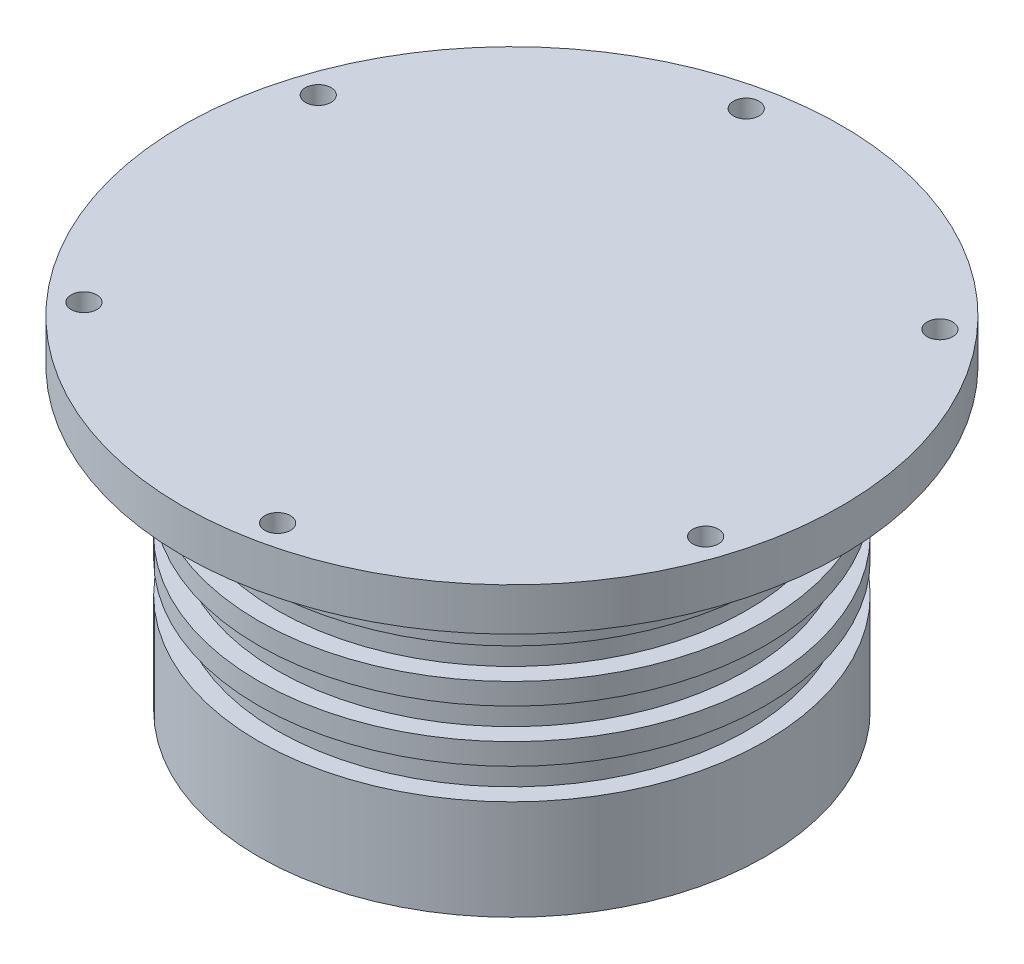
ISO-10303-21;
HEADER;
FILE_DESCRIPTION(('STEP AP214'),'2;1');
FILE_NAME('part.step','',(''),(''),'','','');
FILE_SCHEMA(('AUTOMOTIVE_DESIGN { 1 0 10303 214 1 1 1 1 }'));
ENDSEC;
DATA;
#1=APPLICATION_CONTEXT('core data for automotive mechanical design processes');
#2=APPLICATION_PROTOCOL_DEFINITION('international standard','automotive_design',2000,#1);
#3=PRODUCT_CONTEXT('',#1,'mechanical');
#4=PRODUCT('Part','Part','',(#3));
#5=PRODUCT_RELATED_PRODUCT_CATEGORY('part','',(#4));
#6=PRODUCT_DEFINITION_FORMATION('','',#4);
#7=PRODUCT_DEFINITION_CONTEXT('part definition',#1,'design');
#8=PRODUCT_DEFINITION('design','',#6,#7);
#9=PRODUCT_DEFINITION_SHAPE('','',#8);
#10=(LENGTH_UNIT() NAMED_UNIT(*) SI_UNIT(.MILLI.,.METRE.));
#11=(NAMED_UNIT(*) PLANE_ANGLE_UNIT() SI_UNIT($,.RADIAN.));
#12=(NAMED_UNIT(*) SI_UNIT($,.STERADIAN.) SOLID_ANGLE_UNIT());
#13=UNCERTAINTY_MEASURE_WITH_UNIT(LENGTH_MEASURE(1.E-05),#10,'distance_accuracy_value','');
#14=(GEOMETRIC_REPRESENTATION_CONTEXT(3) GLOBAL_UNCERTAINTY_ASSIGNED_CONTEXT((#13)) GLOBAL_UNIT_ASSIGNED_CONTEXT((#10,
#11,#12)) REPRESENTATION_CONTEXT('',''));
#15=CARTESIAN_POINT('',(0.,0.,0.));
#16=DIRECTION('',(0.,0.,1.));
#17=DIRECTION('',(1.,0.,0.));
#18=AXIS2_PLACEMENT_3D('',#15,#16,#17);
#19=CARTESIAN_POINT('',(0.,93.9493256003392,0.));
#20=DIRECTION('',(0.,-1.,0.));
#21=DIRECTION('',(0.,0.,-1.));
#22=AXIS2_PLACEMENT_3D('',#19,#20,#21);
#23=PLANE('',#22);
#24=CARTESIAN_POINT('',(-67.4160325954417,93.9493256003392,-22.0808095207213));
#25=DIRECTION('',(0.,-1.,0.));
#26=DIRECTION('',(0.,0.,-1.));
#27=AXIS2_PLACEMENT_3D('',#24,#25,#26);
#28=CIRCLE('',#27,3.00000000000001);
#29=CARTESIAN_POINT('',(-67.4160325954417,93.9493256003392,-25.0808095207213));
#30=VERTEX_POINT('',#29);
#31=EDGE_CURVE('E78',#30,#30,#28,.F.);
#32=ORIENTED_EDGE('',*,*,#31,.F.);
#33=EDGE_LOOP('',(#32));
#34=FACE_BOUND('',#33,.T.);
#35=CARTESIAN_POINT('',(-14.5854743166509,93.9493256003392,-69.4244016103729));
#36=DIRECTION('',(0.,-1.,0.));
#37=DIRECTION('',(0.,0.,-1.));
#38=AXIS2_PLACEMENT_3D('',#35,#36,#37);
#39=CIRCLE('',#38,3.);
#40=CARTESIAN_POINT('',(-14.5854743166509,93.9493256003392,-72.4244016103729));
#41=VERTEX_POINT('',#40);
#42=EDGE_CURVE('E66',#41,#41,#39,.F.);
#43=ORIENTED_EDGE('',*,*,#42,.F.);
#44=EDGE_LOOP('',(#43));
#45=FACE_BOUND('',#44,.T.);
#46=CARTESIAN_POINT('',(52.8305582787908,93.9493256003392,-47.3435920896516));
#47=DIRECTION('',(0.,-1.,0.));
#48=DIRECTION('',(0.,0.,-1.));
#49=AXIS2_PLACEMENT_3D('',#46,#47,#48);
#50=CIRCLE('',#49,3.);
#51=CARTESIAN_POINT('',(52.8305582787908,93.9493256003392,-50.3435920896516));
#52=VERTEX_POINT('',#51);
#53=EDGE_CURVE('E63',#52,#52,#50,.F.);
#54=ORIENTED_EDGE('',*,*,#53,.F.);
#55=EDGE_LOOP('',(#54));
#56=FACE_BOUND('',#55,.T.);
#57=CARTESIAN_POINT('',(67.4160325954416,93.9493256003392,22.0808095207213));
#58=DIRECTION('',(0.,-1.,0.));
#59=DIRECTION('',(0.,0.,-1.));
#60=AXIS2_PLACEMENT_3D('',#57,#58,#59);
#61=CIRCLE('',#60,3.00000000000001);
#62=CARTESIAN_POINT('',(67.4160325954416,93.9493256003392,19.0808095207213));
#63=VERTEX_POINT('',#62);
#64=EDGE_CURVE('E60',#63,#63,#61,.F.);
#65=ORIENTED_EDGE('',*,*,#64,.F.);
#66=EDGE_LOOP('',(#65));
#67=FACE_BOUND('',#66,.T.);
#68=CARTESIAN_POINT('',(14.5854743166508,93.9493256003392,69.4244016103729));
#69=DIRECTION('',(0.,-1.,0.));
#70=DIRECTION('',(0.,0.,-1.));
#71=AXIS2_PLACEMENT_3D('',#68,#69,#70);
#72=CIRCLE('',#71,3.);
#73=CARTESIAN_POINT('',(14.5854743166508,93.9493256003392,66.4244016103729));
#74=VERTEX_POINT('',#73);
#75=EDGE_CURVE('E56',#74,#74,#72,.F.);
#76=ORIENTED_EDGE('',*,*,#75,.F.);
#77=EDGE_LOOP('',(#76));
#78=FACE_BOUND('',#77,.T.);
#79=CARTESIAN_POINT('',(-52.8305582787908,93.9493256003392,47.3435920896516));
#80=DIRECTION('',(0.,-1.,0.));
#81=DIRECTION('',(0.,0.,-1.));
#82=AXIS2_PLACEMENT_3D('',#79,#80,#81);
#83=CIRCLE('',#82,3.);
#84=CARTESIAN_POINT('',(-52.8305582787908,93.9493256003392,44.3435920896516));
#85=VERTEX_POINT('',#84);
#86=EDGE_CURVE('E52',#85,#85,#83,.F.);
#87=ORIENTED_EDGE('',*,*,#86,.F.);
#88=EDGE_LOOP('',(#87));
#89=FACE_BOUND('',#88,.T.);
#90=CARTESIAN_POINT('',(0.,93.9493256003392,0.));
#91=DIRECTION('',(0.,1.,0.));
#92=DIRECTION('',(0.,0.,1.));
#93=AXIS2_PLACEMENT_3D('',#90,#91,#92);
#94=CIRCLE('',#93,77.14);
#95=CARTESIAN_POINT('',(0.,93.9493256003392,77.14));
#96=VERTEX_POINT('',#95);
#97=EDGE_CURVE('E10',#96,#96,#94,.T.);
#98=ORIENTED_EDGE('',*,*,#97,.T.);
#99=EDGE_LOOP('',(#98));
#100=FACE_BOUND('',#99,.T.);
#101=ADVANCED_FACE('F33',(#34,#45,#56,#67,#78,#89,#100),#23,.F.);
#102=CARTESIAN_POINT('',(0.,93.9493256003392,0.));
#103=DIRECTION('',(0.,1.,0.));
#104=DIRECTION('',(0.,0.,1.));
#105=AXIS2_PLACEMENT_3D('',#102,#103,#104);
#106=CYLINDRICAL_SURFACE('',#105,77.14);
#107=ORIENTED_EDGE('',*,*,#97,.F.);
#108=EDGE_LOOP('',(#107));
#109=FACE_BOUND('',#108,.T.);
#110=CARTESIAN_POINT('',(0.,83.9493256003392,0.));
#111=DIRECTION('',(0.,1.,0.));
#112=DIRECTION('',(0.,0.,1.));
#113=AXIS2_PLACEMENT_3D('',#110,#111,#112);
#114=CIRCLE('',#113,77.14);
#115=CARTESIAN_POINT('',(0.,83.9493256003392,77.14));
#116=VERTEX_POINT('',#115);
#117=EDGE_CURVE('E40',#116,#116,#114,.T.);
#118=ORIENTED_EDGE('',*,*,#117,.T.);
#119=EDGE_LOOP('',(#118));
#120=FACE_BOUND('',#119,.T.);
#121=ADVANCED_FACE('F213',(#109,#120),#106,.T.);
#122=CARTESIAN_POINT('',(77.14,83.9493256003392,0.));
#123=DIRECTION('',(0.,1.,0.));
#124=DIRECTION('',(0.,0.,1.));
#125=AXIS2_PLACEMENT_3D('',#122,#123,#124);
#126=PLANE('',#125);
#127=CARTESIAN_POINT('',(-67.4160325954417,83.9493256003392,-22.0808095207213));
#128=DIRECTION('',(0.,1.,0.));
#129=DIRECTION('',(0.,0.,1.));
#130=AXIS2_PLACEMENT_3D('',#127,#128,#129);
#131=CIRCLE('',#130,3.00000000000001);
#132=CARTESIAN_POINT('',(-67.4160325954417,83.9493256003392,-19.0808095207213));
#133=VERTEX_POINT('',#132);
#134=EDGE_CURVE('E36',#133,#133,#131,.F.);
#135=ORIENTED_EDGE('',*,*,#134,.F.);
#136=EDGE_LOOP('',(#135));
#137=FACE_BOUND('',#136,.T.);
#138=CARTESIAN_POINT('',(-14.5854743166509,83.9493256003392,-69.4244016103729));
#139=DIRECTION('',(0.,1.,0.));
#140=DIRECTION('',(0.,0.,1.));
#141=AXIS2_PLACEMENT_3D('',#138,#139,#140);
#142=CIRCLE('',#141,3.);
#143=CARTESIAN_POINT('',(-14.5854743166509,83.9493256003392,-66.4244016103729));
#144=VERTEX_POINT('',#143);
#145=EDGE_CURVE('E64',#144,#144,#142,.F.);
#146=ORIENTED_EDGE('',*,*,#145,.F.);
#147=EDGE_LOOP('',(#146));
#148=FACE_BOUND('',#147,.T.);
#149=CARTESIAN_POINT('',(52.8305582787908,83.9493256003392,-47.3435920896516));
#150=DIRECTION('',(0.,1.,0.));
#151=DIRECTION('',(0.,0.,1.));
#152=AXIS2_PLACEMENT_3D('',#149,#150,#151);
#153=CIRCLE('',#152,3.);
#154=CARTESIAN_POINT('',(52.8305582787908,83.9493256003392,-44.3435920896516));
#155=VERTEX_POINT('',#154);
#156=EDGE_CURVE('E61',#155,#155,#153,.F.);
#157=ORIENTED_EDGE('',*,*,#156,.F.);
#158=EDGE_LOOP('',(#157));
#159=FACE_BOUND('',#158,.T.);
#160=CARTESIAN_POINT('',(67.4160325954416,83.9493256003392,22.0808095207213));
#161=DIRECTION('',(0.,1.,0.));
#162=DIRECTION('',(0.,0.,1.));
#163=AXIS2_PLACEMENT_3D('',#160,#161,#162);
#164=CIRCLE('',#163,3.00000000000001);
#165=CARTESIAN_POINT('',(67.4160325954416,83.9493256003392,25.0808095207213));
#166=VERTEX_POINT('',#165);
#167=EDGE_CURVE('E57',#166,#166,#164,.F.);
#168=ORIENTED_EDGE('',*,*,#167,.F.);
#169=EDGE_LOOP('',(#168));
#170=FACE_BOUND('',#169,.T.);
#171=CARTESIAN_POINT('',(14.5854743166508,83.9493256003392,69.4244016103729));
#172=DIRECTION('',(0.,1.,0.));
#173=DIRECTION('',(0.,0.,1.));
#174=AXIS2_PLACEMENT_3D('',#171,#172,#173);
#175=CIRCLE('',#174,3.);
#176=CARTESIAN_POINT('',(14.5854743166508,83.9493256003392,72.4244016103729));
#177=VERTEX_POINT('',#176);
#178=EDGE_CURVE('E53',#177,#177,#175,.F.);
#179=ORIENTED_EDGE('',*,*,#178,.F.);
#180=EDGE_LOOP('',(#179));
#181=FACE_BOUND('',#180,.T.);
#182=CARTESIAN_POINT('',(-52.8305582787908,83.9493256003392,47.3435920896516));
#183=DIRECTION('',(0.,1.,0.));
#184=DIRECTION('',(0.,0.,1.));
#185=AXIS2_PLACEMENT_3D('',#182,#183,#184);
#186=CIRCLE('',#185,3.);
#187=CARTESIAN_POINT('',(-52.8305582787908,83.9493256003392,50.3435920896516));
#188=VERTEX_POINT('',#187);
#189=EDGE_CURVE('E49',#188,#188,#186,.F.);
#190=ORIENTED_EDGE('',*,*,#189,.F.);
#191=EDGE_LOOP('',(#190));
#192=FACE_BOUND('',#191,.T.);
#193=ORIENTED_EDGE('',*,*,#117,.F.);
#194=EDGE_LOOP('',(#193));
#195=FACE_BOUND('',#194,.T.);
#196=CARTESIAN_POINT('',(0.,83.9493256003392,0.));
#197=DIRECTION('',(0.,1.,0.));
#198=DIRECTION('',(0.,0.,1.));
#199=AXIS2_PLACEMENT_3D('',#196,#197,#198);
#200=CIRCLE('',#199,59.3);
#201=CARTESIAN_POINT('',(0.,83.9493256003392,59.3));
#202=VERTEX_POINT('',#201);
#203=EDGE_CURVE('E45',#202,#202,#200,.T.);
#204=ORIENTED_EDGE('',*,*,#203,.T.);
#205=EDGE_LOOP('',(#204));
#206=FACE_BOUND('',#205,.T.);
#207=ADVANCED_FACE('F122',(#137,#148,#159,#170,#181,#192,#195,#206),#126,.F.);
#208=CARTESIAN_POINT('',(0.,93.9493256003392,0.));
#209=DIRECTION('',(0.,1.,0.));
#210=DIRECTION('',(0.,0.,1.));
#211=AXIS2_PLACEMENT_3D('',#208,#209,#210);
#212=CYLINDRICAL_SURFACE('',#211,59.3);
#213=ORIENTED_EDGE('',*,*,#203,.F.);
#214=EDGE_LOOP('',(#213));
#215=FACE_BOUND('',#214,.T.);
#216=CARTESIAN_POINT('',(0.,68.9493256003392,0.));
#217=DIRECTION('',(0.,1.,0.));
#218=DIRECTION('',(0.,0.,1.));
#219=AXIS2_PLACEMENT_3D('',#216,#217,#218);
#220=CIRCLE('',#219,59.3);
#221=CARTESIAN_POINT('',(0.,68.9493256003392,59.3));
#222=VERTEX_POINT('',#221);
#223=EDGE_CURVE('E117',#222,#222,#220,.T.);
#224=ORIENTED_EDGE('',*,*,#223,.T.);
#225=EDGE_LOOP('',(#224));
#226=FACE_BOUND('',#225,.T.);
#227=ADVANCED_FACE('F124',(#215,#226),#212,.T.);
#228=CARTESIAN_POINT('',(59.3,68.9493256003392,0.));
#229=DIRECTION('',(0.,1.,0.));
#230=DIRECTION('',(0.,0.,1.));
#231=AXIS2_PLACEMENT_3D('',#228,#229,#230);
#232=PLANE('',#231);
#233=ORIENTED_EDGE('',*,*,#223,.F.);
#234=EDGE_LOOP('',(#233));
#235=FACE_BOUND('',#234,.T.);
#236=CARTESIAN_POINT('',(0.,68.9493256003392,0.));
#237=DIRECTION('',(0.,1.,0.));
#238=DIRECTION('',(0.,0.,1.));
#239=AXIS2_PLACEMENT_3D('',#236,#237,#238);
#240=CIRCLE('',#239,55.);
#241=CARTESIAN_POINT('',(0.,68.9493256003392,55.));
#242=VERTEX_POINT('',#241);
#243=EDGE_CURVE('E114',#242,#242,#240,.T.);
#244=ORIENTED_EDGE('',*,*,#243,.T.);
#245=EDGE_LOOP('',(#244));
#246=FACE_BOUND('',#245,.T.);
#247=ADVANCED_FACE('F127',(#235,#246),#232,.F.);
#248=CARTESIAN_POINT('',(0.,93.9493256003392,0.));
#249=DIRECTION('',(0.,1.,0.));
#250=DIRECTION('',(0.,0.,1.));
#251=AXIS2_PLACEMENT_3D('',#248,#249,#250);
#252=CYLINDRICAL_SURFACE('',#251,55.);
#253=ORIENTED_EDGE('',*,*,#243,.F.);
#254=EDGE_LOOP('',(#253));
#255=FACE_BOUND('',#254,.T.);
#256=CARTESIAN_POINT('',(0.,61.7493256003392,0.));
#257=DIRECTION('',(0.,1.,0.));
#258=DIRECTION('',(0.,0.,1.));
#259=AXIS2_PLACEMENT_3D('',#256,#257,#258);
#260=CIRCLE('',#259,55.);
#261=CARTESIAN_POINT('',(0.,61.7493256003392,55.));
#262=VERTEX_POINT('',#261);
#263=EDGE_CURVE('E111',#262,#262,#260,.T.);
#264=ORIENTED_EDGE('',*,*,#263,.T.);
#265=EDGE_LOOP('',(#264));
#266=FACE_BOUND('',#265,.T.);
#267=ADVANCED_FACE('F133',(#255,#266),#252,.T.);
#268=CARTESIAN_POINT('',(55.,61.7493256003392,0.));
#269=DIRECTION('',(0.,-1.,0.));
#270=DIRECTION('',(0.,0.,-1.));
#271=AXIS2_PLACEMENT_3D('',#268,#269,#270);
#272=PLANE('',#271);
#273=ORIENTED_EDGE('',*,*,#263,.F.);
#274=EDGE_LOOP('',(#273));
#275=FACE_BOUND('',#274,.T.);
#276=CARTESIAN_POINT('',(0.,61.7493256003392,0.));
#277=DIRECTION('',(0.,1.,0.));
#278=DIRECTION('',(0.,0.,1.));
#279=AXIS2_PLACEMENT_3D('',#276,#277,#278);
#280=CIRCLE('',#279,59.3);
#281=CARTESIAN_POINT('',(0.,61.7493256003392,59.3));
#282=VERTEX_POINT('',#281);
#283=EDGE_CURVE('E108',#282,#282,#280,.T.);
#284=ORIENTED_EDGE('',*,*,#283,.T.);
#285=EDGE_LOOP('',(#284));
#286=FACE_BOUND('',#285,.T.);
#287=ADVANCED_FACE('F139',(#275,#286),#272,.F.);
#288=CARTESIAN_POINT('',(0.,93.9493256003392,0.));
#289=DIRECTION('',(0.,1.,0.));
#290=DIRECTION('',(0.,0.,1.));
#291=AXIS2_PLACEMENT_3D('',#288,#289,#290);
#292=CYLINDRICAL_SURFACE('',#291,59.3);
#293=ORIENTED_EDGE('',*,*,#283,.F.);
#294=EDGE_LOOP('',(#293));
#295=FACE_BOUND('',#294,.T.);
#296=CARTESIAN_POINT('',(0.,56.7493256003392,0.));
#297=DIRECTION('',(0.,1.,0.));
#298=DIRECTION('',(0.,0.,1.));
#299=AXIS2_PLACEMENT_3D('',#296,#297,#298);
#300=CIRCLE('',#299,59.2999999999999);
#301=CARTESIAN_POINT('',(0.,56.7493256003392,59.2999999999999));
#302=VERTEX_POINT('',#301);
#303=EDGE_CURVE('E105',#302,#302,#300,.T.);
#304=ORIENTED_EDGE('',*,*,#303,.T.);
#305=EDGE_LOOP('',(#304));
#306=FACE_BOUND('',#305,.T.);
#307=ADVANCED_FACE('F145',(#295,#306),#292,.T.);
#308=CARTESIAN_POINT('',(59.2999999999999,56.7493256003392,0.));
#309=DIRECTION('',(0.,1.,0.));
#310=DIRECTION('',(0.,0.,1.));
#311=AXIS2_PLACEMENT_3D('',#308,#309,#310);
#312=PLANE('',#311);
#313=ORIENTED_EDGE('',*,*,#303,.F.);
#314=EDGE_LOOP('',(#313));
#315=FACE_BOUND('',#314,.T.);
#316=CARTESIAN_POINT('',(0.,56.7493256003392,0.));
#317=DIRECTION('',(0.,1.,0.));
#318=DIRECTION('',(0.,0.,1.));
#319=AXIS2_PLACEMENT_3D('',#316,#317,#318);
#320=CIRCLE('',#319,55.);
#321=CARTESIAN_POINT('',(0.,56.7493256003392,55.));
#322=VERTEX_POINT('',#321);
#323=EDGE_CURVE('E102',#322,#322,#320,.T.);
#324=ORIENTED_EDGE('',*,*,#323,.T.);
#325=EDGE_LOOP('',(#324));
#326=FACE_BOUND('',#325,.T.);
#327=ADVANCED_FACE('F151',(#315,#326),#312,.F.);
#328=CARTESIAN_POINT('',(0.,93.9493256003392,0.));
#329=DIRECTION('',(0.,1.,0.));
#330=DIRECTION('',(0.,0.,1.));
#331=AXIS2_PLACEMENT_3D('',#328,#329,#330);
#332=CYLINDRICAL_SURFACE('',#331,55.);
#333=ORIENTED_EDGE('',*,*,#323,.F.);
#334=EDGE_LOOP('',(#333));
#335=FACE_BOUND('',#334,.T.);
#336=CARTESIAN_POINT('',(0.,49.5493256003392,0.));
#337=DIRECTION('',(0.,1.,0.));
#338=DIRECTION('',(0.,0.,1.));
#339=AXIS2_PLACEMENT_3D('',#336,#337,#338);
#340=CIRCLE('',#339,55.);
#341=CARTESIAN_POINT('',(0.,49.5493256003392,55.));
#342=VERTEX_POINT('',#341);
#343=EDGE_CURVE('E99',#342,#342,#340,.T.);
#344=ORIENTED_EDGE('',*,*,#343,.T.);
#345=EDGE_LOOP('',(#344));
#346=FACE_BOUND('',#345,.T.);
#347=ADVANCED_FACE('F157',(#335,#346),#332,.T.);
#348=CARTESIAN_POINT('',(55.,49.5493256003392,0.));
#349=DIRECTION('',(0.,-1.,0.));
#350=DIRECTION('',(0.,0.,-1.));
#351=AXIS2_PLACEMENT_3D('',#348,#349,#350);
#352=PLANE('',#351);
#353=ORIENTED_EDGE('',*,*,#343,.F.);
#354=EDGE_LOOP('',(#353));
#355=FACE_BOUND('',#354,.T.);
#356=CARTESIAN_POINT('',(0.,49.5493256003392,0.));
#357=DIRECTION('',(0.,1.,0.));
#358=DIRECTION('',(0.,0.,1.));
#359=AXIS2_PLACEMENT_3D('',#356,#357,#358);
#360=CIRCLE('',#359,59.3);
#361=CARTESIAN_POINT('',(0.,49.5493256003392,59.3));
#362=VERTEX_POINT('',#361);
#363=EDGE_CURVE('E96',#362,#362,#360,.T.);
#364=ORIENTED_EDGE('',*,*,#363,.T.);
#365=EDGE_LOOP('',(#364));
#366=FACE_BOUND('',#365,.T.);
#367=ADVANCED_FACE('F163',(#355,#366),#352,.F.);
#368=CARTESIAN_POINT('',(0.,93.9493256003392,0.));
#369=DIRECTION('',(0.,1.,0.));
#370=DIRECTION('',(0.,0.,1.));
#371=AXIS2_PLACEMENT_3D('',#368,#369,#370);
#372=CYLINDRICAL_SURFACE('',#371,59.3);
#373=ORIENTED_EDGE('',*,*,#363,.F.);
#374=EDGE_LOOP('',(#373));
#375=FACE_BOUND('',#374,.T.);
#376=CARTESIAN_POINT('',(0.,44.5493256003392,0.));
#377=DIRECTION('',(0.,1.,0.));
#378=DIRECTION('',(0.,0.,1.));
#379=AXIS2_PLACEMENT_3D('',#376,#377,#378);
#380=CIRCLE('',#379,59.3);
#381=CARTESIAN_POINT('',(0.,44.5493256003392,59.3));
#382=VERTEX_POINT('',#381);
#383=EDGE_CURVE('E93',#382,#382,#380,.T.);
#384=ORIENTED_EDGE('',*,*,#383,.T.);
#385=EDGE_LOOP('',(#384));
#386=FACE_BOUND('',#385,.T.);
#387=ADVANCED_FACE('F169',(#375,#386),#372,.T.);
#388=CARTESIAN_POINT('',(59.3,44.5493256003392,0.));
#389=DIRECTION('',(0.,1.,0.));
#390=DIRECTION('',(0.,0.,1.));
#391=AXIS2_PLACEMENT_3D('',#388,#389,#390);
#392=PLANE('',#391);
#393=ORIENTED_EDGE('',*,*,#383,.F.);
#394=EDGE_LOOP('',(#393));
#395=FACE_BOUND('',#394,.T.);
#396=CARTESIAN_POINT('',(0.,44.5493256003392,0.));
#397=DIRECTION('',(0.,1.,0.));
#398=DIRECTION('',(0.,0.,1.));
#399=AXIS2_PLACEMENT_3D('',#396,#397,#398);
#400=CIRCLE('',#399,55.);
#401=CARTESIAN_POINT('',(0.,44.5493256003392,55.));
#402=VERTEX_POINT('',#401);
#403=EDGE_CURVE('E90',#402,#402,#400,.T.);
#404=ORIENTED_EDGE('',*,*,#403,.T.);
#405=EDGE_LOOP('',(#404));
#406=FACE_BOUND('',#405,.T.);
#407=ADVANCED_FACE('F175',(#395,#406),#392,.F.);
#408=CARTESIAN_POINT('',(0.,93.9493256003392,0.));
#409=DIRECTION('',(0.,1.,0.));
#410=DIRECTION('',(0.,0.,1.));
#411=AXIS2_PLACEMENT_3D('',#408,#409,#410);
#412=CYLINDRICAL_SURFACE('',#411,55.);
#413=ORIENTED_EDGE('',*,*,#403,.F.);
#414=EDGE_LOOP('',(#413));
#415=FACE_BOUND('',#414,.T.);
#416=CARTESIAN_POINT('',(0.,37.3493256003392,0.));
#417=DIRECTION('',(0.,1.,0.));
#418=DIRECTION('',(0.,0.,1.));
#419=AXIS2_PLACEMENT_3D('',#416,#417,#418);
#420=CIRCLE('',#419,54.9999999999999);
#421=CARTESIAN_POINT('',(0.,37.3493256003392,54.9999999999999));
#422=VERTEX_POINT('',#421);
#423=EDGE_CURVE('E87',#422,#422,#420,.T.);
#424=ORIENTED_EDGE('',*,*,#423,.T.);
#425=EDGE_LOOP('',(#424));
#426=FACE_BOUND('',#425,.T.);
#427=ADVANCED_FACE('F181',(#415,#426),#412,.T.);
#428=CARTESIAN_POINT('',(54.9999999999999,37.3493256003392,0.));
#429=DIRECTION('',(0.,-1.,0.));
#430=DIRECTION('',(0.,0.,-1.));
#431=AXIS2_PLACEMENT_3D('',#428,#429,#430);
#432=PLANE('',#431);
#433=ORIENTED_EDGE('',*,*,#423,.F.);
#434=EDGE_LOOP('',(#433));
#435=FACE_BOUND('',#434,.T.);
#436=CARTESIAN_POINT('',(0.,37.3493256003392,0.));
#437=DIRECTION('',(0.,1.,0.));
#438=DIRECTION('',(0.,0.,1.));
#439=AXIS2_PLACEMENT_3D('',#436,#437,#438);
#440=CIRCLE('',#439,59.3);
#441=CARTESIAN_POINT('',(0.,37.3493256003392,59.3));
#442=VERTEX_POINT('',#441);
#443=EDGE_CURVE('E84',#442,#442,#440,.T.);
#444=ORIENTED_EDGE('',*,*,#443,.T.);
#445=EDGE_LOOP('',(#444));
#446=FACE_BOUND('',#445,.T.);
#447=ADVANCED_FACE('F187',(#435,#446),#432,.F.);
#448=CARTESIAN_POINT('',(0.,93.9493256003392,0.));
#449=DIRECTION('',(0.,1.,0.));
#450=DIRECTION('',(0.,0.,1.));
#451=AXIS2_PLACEMENT_3D('',#448,#449,#450);
#452=CYLINDRICAL_SURFACE('',#451,59.3);
#453=ORIENTED_EDGE('',*,*,#443,.F.);
#454=EDGE_LOOP('',(#453));
#455=FACE_BOUND('',#454,.T.);
#456=CARTESIAN_POINT('',(0.,13.9493256003392,0.));
#457=DIRECTION('',(0.,1.,0.));
#458=DIRECTION('',(0.,0.,1.));
#459=AXIS2_PLACEMENT_3D('',#456,#457,#458);
#460=CIRCLE('',#459,59.3);
#461=CARTESIAN_POINT('',(0.,13.9493256003392,59.3));
#462=VERTEX_POINT('',#461);
#463=EDGE_CURVE('E81',#462,#462,#460,.T.);
#464=ORIENTED_EDGE('',*,*,#463,.T.);
#465=EDGE_LOOP('',(#464));
#466=FACE_BOUND('',#465,.T.);
#467=ADVANCED_FACE('F193',(#455,#466),#452,.T.);
#468=CARTESIAN_POINT('',(55.,13.9493256003392,0.));
#469=DIRECTION('',(0.,1.,0.));
#470=DIRECTION('',(0.,0.,1.));
#471=AXIS2_PLACEMENT_3D('',#468,#469,#470);
#472=PLANE('',#471);
#473=ORIENTED_EDGE('',*,*,#463,.F.);
#474=EDGE_LOOP('',(#473));
#475=FACE_BOUND('',#474,.T.);
#476=ADVANCED_FACE('F199',(#475),#472,.F.);
#477=CARTESIAN_POINT('',(-52.8305582787908,164.,47.3435920896516));
#478=DIRECTION('',(0.,-1.,0.));
#479=DIRECTION('',(0.,0.,-1.));
#480=AXIS2_PLACEMENT_3D('',#477,#478,#479);
#481=CYLINDRICAL_SURFACE('',#480,3.);
#482=ORIENTED_EDGE('',*,*,#189,.T.);
#483=EDGE_LOOP('',(#482));
#484=FACE_BOUND('',#483,.T.);
#485=ORIENTED_EDGE('',*,*,#86,.T.);
#486=EDGE_LOOP('',(#485));
#487=FACE_BOUND('',#486,.T.);
#488=ADVANCED_FACE('F204',(#484,#487),#481,.F.);
#489=CARTESIAN_POINT('',(14.5854743166508,164.,69.4244016103729));
#490=DIRECTION('',(0.,-1.,0.));
#491=DIRECTION('',(0.,0.,-1.));
#492=AXIS2_PLACEMENT_3D('',#489,#490,#491);
#493=CYLINDRICAL_SURFACE('',#492,3.);
#494=ORIENTED_EDGE('',*,*,#178,.T.);
#495=EDGE_LOOP('',(#494));
#496=FACE_BOUND('',#495,.T.);
#497=ORIENTED_EDGE('',*,*,#75,.T.);
#498=EDGE_LOOP('',(#497));
#499=FACE_BOUND('',#498,.T.);
#500=ADVANCED_FACE('F209',(#496,#499),#493,.F.);
#501=CARTESIAN_POINT('',(67.4160325954416,164.,22.0808095207213));
#502=DIRECTION('',(0.,-1.,0.));
#503=DIRECTION('',(0.,0.,-1.));
#504=AXIS2_PLACEMENT_3D('',#501,#502,#503);
#505=CYLINDRICAL_SURFACE('',#504,3.00000000000001);
#506=ORIENTED_EDGE('',*,*,#167,.T.);
#507=EDGE_LOOP('',(#506));
#508=FACE_BOUND('',#507,.T.);
#509=ORIENTED_EDGE('',*,*,#64,.T.);
#510=EDGE_LOOP('',(#509));
#511=FACE_BOUND('',#510,.T.);
#512=ADVANCED_FACE('F236',(#508,#511),#505,.F.);
#513=CARTESIAN_POINT('',(52.8305582787908,164.,-47.3435920896516));
#514=DIRECTION('',(0.,-1.,0.));
#515=DIRECTION('',(0.,0.,-1.));
#516=AXIS2_PLACEMENT_3D('',#513,#514,#515);
#517=CYLINDRICAL_SURFACE('',#516,3.);
#518=ORIENTED_EDGE('',*,*,#156,.T.);
#519=EDGE_LOOP('',(#518));
#520=FACE_BOUND('',#519,.T.);
#521=ORIENTED_EDGE('',*,*,#53,.T.);
#522=EDGE_LOOP('',(#521));
#523=FACE_BOUND('',#522,.T.);
#524=ADVANCED_FACE('F242',(#520,#523),#517,.F.);
#525=CARTESIAN_POINT('',(-14.5854743166509,164.,-69.4244016103729));
#526=DIRECTION('',(0.,-1.,0.));
#527=DIRECTION('',(0.,0.,-1.));
#528=AXIS2_PLACEMENT_3D('',#525,#526,#527);
#529=CYLINDRICAL_SURFACE('',#528,3.);
#530=ORIENTED_EDGE('',*,*,#145,.T.);
#531=EDGE_LOOP('',(#530));
#532=FACE_BOUND('',#531,.T.);
#533=ORIENTED_EDGE('',*,*,#42,.T.);
#534=EDGE_LOOP('',(#533));
#535=FACE_BOUND('',#534,.T.);
#536=ADVANCED_FACE('F248',(#532,#535),#529,.F.);
#537=CARTESIAN_POINT('',(-67.4160325954417,164.,-22.0808095207213));
#538=DIRECTION('',(0.,-1.,0.));
#539=DIRECTION('',(0.,0.,-1.));
#540=AXIS2_PLACEMENT_3D('',#537,#538,#539);
#541=CYLINDRICAL_SURFACE('',#540,3.00000000000001);
#542=ORIENTED_EDGE('',*,*,#134,.T.);
#543=EDGE_LOOP('',(#542));
#544=FACE_BOUND('',#543,.T.);
#545=ORIENTED_EDGE('',*,*,#31,.T.);
#546=EDGE_LOOP('',(#545));
#547=FACE_BOUND('',#546,.T.);
#548=ADVANCED_FACE('F252',(#544,#547),#541,.F.);
#549=CLOSED_SHELL('',(#101,#121,#207,#227,#247,#267,#287,#307,#327,#347,#367,#387,#407,#427,
#447,#467,#476,#488,#500,#512,#524,#536,#548));
#550=MANIFOLD_SOLID_BREP('B2',#549);
#551=ADVANCED_BREP_SHAPE_REPRESENTATION('',(#18,#550),#14);
#552=SHAPE_DEFINITION_REPRESENTATION(#9,#551);
ENDSEC;
END-ISO-10303-21;
